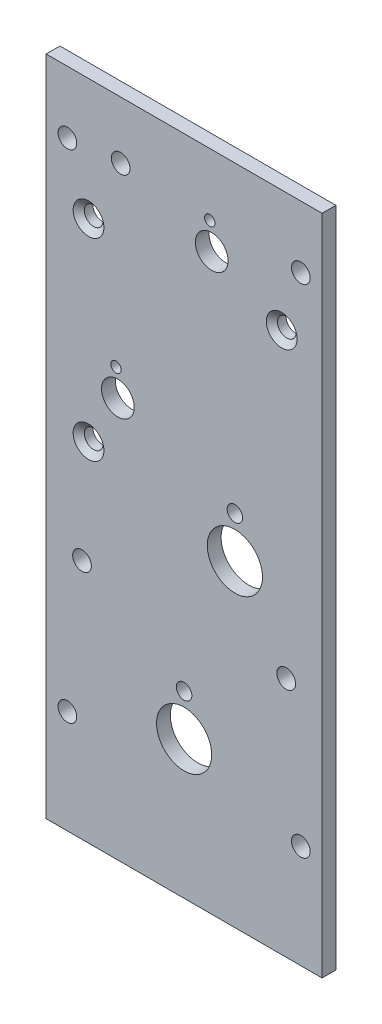
ISO-10303-21;
HEADER;
FILE_DESCRIPTION(('STEP AP214'),'2;1');
FILE_NAME('part.step','',(''),(''),'','','');
FILE_SCHEMA(('AUTOMOTIVE_DESIGN { 1 0 10303 214 1 1 1 1 }'));
ENDSEC;
DATA;
#1=APPLICATION_CONTEXT('core data for automotive mechanical design processes');
#2=APPLICATION_PROTOCOL_DEFINITION('international standard','automotive_design',2000,#1);
#3=PRODUCT_CONTEXT('',#1,'mechanical');
#4=PRODUCT('Part','Part','',(#3));
#5=PRODUCT_RELATED_PRODUCT_CATEGORY('part','',(#4));
#6=PRODUCT_DEFINITION_FORMATION('','',#4);
#7=PRODUCT_DEFINITION_CONTEXT('part definition',#1,'design');
#8=PRODUCT_DEFINITION('design','',#6,#7);
#9=PRODUCT_DEFINITION_SHAPE('','',#8);
#10=(LENGTH_UNIT() NAMED_UNIT(*) SI_UNIT(.MILLI.,.METRE.));
#11=(NAMED_UNIT(*) PLANE_ANGLE_UNIT() SI_UNIT($,.RADIAN.));
#12=(NAMED_UNIT(*) SI_UNIT($,.STERADIAN.) SOLID_ANGLE_UNIT());
#13=UNCERTAINTY_MEASURE_WITH_UNIT(LENGTH_MEASURE(1.E-05),#10,'distance_accuracy_value','');
#14=(GEOMETRIC_REPRESENTATION_CONTEXT(3) GLOBAL_UNCERTAINTY_ASSIGNED_CONTEXT((#13)) GLOBAL_UNIT_ASSIGNED_CONTEXT((#10,
#11,#12)) REPRESENTATION_CONTEXT('',''));
#15=CARTESIAN_POINT('',(0.,0.,0.));
#16=DIRECTION('',(0.,0.,1.));
#17=DIRECTION('',(1.,0.,0.));
#18=AXIS2_PLACEMENT_3D('',#15,#16,#17);
#19=CARTESIAN_POINT('',(-31.75,-152.4,-3.175));
#20=DIRECTION('',(0.,-1.,0.));
#21=DIRECTION('',(0.,0.,-1.));
#22=AXIS2_PLACEMENT_3D('',#19,#20,#21);
#23=PLANE('',#22);
#24=DIRECTION('',(1.,0.,0.));
#25=VECTOR('',#24,1.);
#26=CARTESIAN_POINT('',(-31.75,-152.4,0.));
#27=LINE('',#26,#25);
#28=CARTESIAN_POINT('',(-31.75,-152.4,0.));
#29=VERTEX_POINT('',#28);
#30=CARTESIAN_POINT('',(31.75,-152.4,0.));
#31=VERTEX_POINT('',#30);
#32=EDGE_CURVE('E97',#29,#31,#27,.T.);
#33=ORIENTED_EDGE('',*,*,#32,.F.);
#34=DIRECTION('',(0.,0.,1.));
#35=VECTOR('',#34,1.);
#36=CARTESIAN_POINT('',(-31.75,-152.4,-3.175));
#37=LINE('',#36,#35);
#38=CARTESIAN_POINT('',(-31.75,-152.4,-3.175));
#39=VERTEX_POINT('',#38);
#40=EDGE_CURVE('E11',#39,#29,#37,.T.);
#41=ORIENTED_EDGE('',*,*,#40,.F.);
#42=DIRECTION('',(1.,0.,0.));
#43=VECTOR('',#42,1.);
#44=CARTESIAN_POINT('',(-31.75,-152.4,-3.175));
#45=LINE('',#44,#43);
#46=CARTESIAN_POINT('',(31.75,-152.4,-3.175));
#47=VERTEX_POINT('',#46);
#48=EDGE_CURVE('E90',#39,#47,#45,.T.);
#49=ORIENTED_EDGE('',*,*,#48,.T.);
#50=DIRECTION('',(0.,0.,1.));
#51=VECTOR('',#50,1.);
#52=CARTESIAN_POINT('',(31.75,-152.4,-3.175));
#53=LINE('',#52,#51);
#54=EDGE_CURVE('E35',#47,#31,#53,.T.);
#55=ORIENTED_EDGE('',*,*,#54,.T.);
#56=EDGE_LOOP('',(#33,#41,#49,#55));
#57=FACE_BOUND('',#56,.T.);
#58=ADVANCED_FACE('F32',(#57),#23,.T.);
#59=CARTESIAN_POINT('',(-31.75,0.,-3.175));
#60=DIRECTION('',(-1.,0.,0.));
#61=DIRECTION('',(0.,0.,1.));
#62=AXIS2_PLACEMENT_3D('',#59,#60,#61);
#63=PLANE('',#62);
#64=DIRECTION('',(0.,-1.,0.));
#65=VECTOR('',#64,1.);
#66=CARTESIAN_POINT('',(-31.75,0.,0.));
#67=LINE('',#66,#65);
#68=CARTESIAN_POINT('',(-31.75,0.,0.));
#69=VERTEX_POINT('',#68);
#70=EDGE_CURVE('E92',#69,#29,#67,.T.);
#71=ORIENTED_EDGE('',*,*,#70,.F.);
#72=DIRECTION('',(0.,0.,1.));
#73=VECTOR('',#72,1.);
#74=CARTESIAN_POINT('',(-31.75,0.,-3.175));
#75=LINE('',#74,#73);
#76=CARTESIAN_POINT('',(-31.75,0.,-3.175));
#77=VERTEX_POINT('',#76);
#78=EDGE_CURVE('E41',#77,#69,#75,.T.);
#79=ORIENTED_EDGE('',*,*,#78,.F.);
#80=DIRECTION('',(0.,-1.,0.));
#81=VECTOR('',#80,1.);
#82=CARTESIAN_POINT('',(-31.75,0.,-3.175));
#83=LINE('',#82,#81);
#84=EDGE_CURVE('E87',#77,#39,#83,.T.);
#85=ORIENTED_EDGE('',*,*,#84,.T.);
#86=ORIENTED_EDGE('',*,*,#40,.T.);
#87=EDGE_LOOP('',(#71,#79,#85,#86));
#88=FACE_BOUND('',#87,.T.);
#89=ADVANCED_FACE('F108',(#88),#63,.T.);
#90=CARTESIAN_POINT('',(31.75,0.,-3.175));
#91=DIRECTION('',(0.,1.,0.));
#92=DIRECTION('',(0.,0.,1.));
#93=AXIS2_PLACEMENT_3D('',#90,#91,#92);
#94=PLANE('',#93);
#95=DIRECTION('',(-1.,0.,0.));
#96=VECTOR('',#95,1.);
#97=CARTESIAN_POINT('',(31.75,0.,0.));
#98=LINE('',#97,#96);
#99=CARTESIAN_POINT('',(31.75,0.,0.));
#100=VERTEX_POINT('',#99);
#101=EDGE_CURVE('E82',#100,#69,#98,.T.);
#102=ORIENTED_EDGE('',*,*,#101,.F.);
#103=DIRECTION('',(0.,0.,1.));
#104=VECTOR('',#103,1.);
#105=CARTESIAN_POINT('',(31.75,0.,-3.175));
#106=LINE('',#105,#104);
#107=CARTESIAN_POINT('',(31.75,0.,-3.175));
#108=VERTEX_POINT('',#107);
#109=EDGE_CURVE('E77',#108,#100,#106,.T.);
#110=ORIENTED_EDGE('',*,*,#109,.F.);
#111=DIRECTION('',(-1.,0.,0.));
#112=VECTOR('',#111,1.);
#113=CARTESIAN_POINT('',(31.75,0.,-3.175));
#114=LINE('',#113,#112);
#115=EDGE_CURVE('E80',#108,#77,#114,.T.);
#116=ORIENTED_EDGE('',*,*,#115,.T.);
#117=ORIENTED_EDGE('',*,*,#78,.T.);
#118=EDGE_LOOP('',(#102,#110,#116,#117));
#119=FACE_BOUND('',#118,.T.);
#120=ADVANCED_FACE('F79',(#119),#94,.T.);
#121=CARTESIAN_POINT('',(31.75,-152.4,-3.175));
#122=DIRECTION('',(1.,0.,0.));
#123=DIRECTION('',(0.,0.,-1.));
#124=AXIS2_PLACEMENT_3D('',#121,#122,#123);
#125=PLANE('',#124);
#126=DIRECTION('',(0.,1.,0.));
#127=VECTOR('',#126,1.);
#128=CARTESIAN_POINT('',(31.75,-152.4,0.));
#129=LINE('',#128,#127);
#130=EDGE_CURVE('E100',#31,#100,#129,.T.);
#131=ORIENTED_EDGE('',*,*,#130,.F.);
#132=ORIENTED_EDGE('',*,*,#54,.F.);
#133=DIRECTION('',(0.,1.,0.));
#134=VECTOR('',#133,1.);
#135=CARTESIAN_POINT('',(31.75,-152.4,-3.175));
#136=LINE('',#135,#134);
#137=EDGE_CURVE('E86',#47,#108,#136,.T.);
#138=ORIENTED_EDGE('',*,*,#137,.T.);
#139=ORIENTED_EDGE('',*,*,#109,.T.);
#140=EDGE_LOOP('',(#131,#132,#138,#139));
#141=FACE_BOUND('',#140,.T.);
#142=ADVANCED_FACE('F89',(#141),#125,.T.);
#143=CARTESIAN_POINT('',(0.,0.,-3.175));
#144=DIRECTION('',(0.,0.,1.));
#145=DIRECTION('',(1.,0.,0.));
#146=AXIS2_PLACEMENT_3D('',#143,#144,#145);
#147=PLANE('',#146);
#148=CARTESIAN_POINT('',(-15.6883805351196,-54.3417772149383,-3.175));
#149=DIRECTION('',(0.,0.,1.));
#150=DIRECTION('',(1.,0.,0.));
#151=AXIS2_PLACEMENT_3D('',#148,#149,#150);
#152=CIRCLE('',#151,1.190625);
#153=CARTESIAN_POINT('',(-14.4977555351196,-54.3417772149383,-3.175));
#154=VERTEX_POINT('',#153);
#155=EDGE_CURVE('E217',#154,#154,#152,.T.);
#156=ORIENTED_EDGE('',*,*,#155,.T.);
#157=EDGE_LOOP('',(#156));
#158=FACE_BOUND('',#157,.T.);
#159=CARTESIAN_POINT('',(5.9016194648804,-14.3367772149383,-3.175));
#160=DIRECTION('',(0.,0.,1.));
#161=DIRECTION('',(1.,0.,0.));
#162=AXIS2_PLACEMENT_3D('',#159,#160,#161);
#163=CIRCLE('',#162,1.190625);
#164=CARTESIAN_POINT('',(7.0922444648804,-14.3367772149383,-3.175));
#165=VERTEX_POINT('',#164);
#166=EDGE_CURVE('E227',#165,#165,#163,.T.);
#167=ORIENTED_EDGE('',*,*,#166,.T.);
#168=EDGE_LOOP('',(#167));
#169=FACE_BOUND('',#168,.T.);
#170=CARTESIAN_POINT('',(-21.99,-72.39,-3.175));
#171=DIRECTION('',(0.,0.,1.));
#172=DIRECTION('',(1.,0.,0.));
#173=AXIS2_PLACEMENT_3D('',#170,#171,#172);
#174=CIRCLE('',#173,2.15265);
#175=CARTESIAN_POINT('',(-19.83735,-72.39,-3.175));
#176=VERTEX_POINT('',#175);
#177=EDGE_CURVE('E236',#176,#176,#174,.T.);
#178=ORIENTED_EDGE('',*,*,#177,.T.);
#179=EDGE_LOOP('',(#178));
#180=FACE_BOUND('',#179,.T.);
#181=CARTESIAN_POINT('',(-21.99,-27.94,-3.175));
#182=DIRECTION('',(0.,0.,1.));
#183=DIRECTION('',(1.,0.,0.));
#184=AXIS2_PLACEMENT_3D('',#181,#182,#183);
#185=CIRCLE('',#184,2.15265);
#186=CARTESIAN_POINT('',(-19.83735,-27.94,-3.175));
#187=VERTEX_POINT('',#186);
#188=EDGE_CURVE('E245',#187,#187,#185,.T.);
#189=ORIENTED_EDGE('',*,*,#188,.T.);
#190=EDGE_LOOP('',(#189));
#191=FACE_BOUND('',#190,.T.);
#192=CARTESIAN_POINT('',(22.46,-27.94,-3.175));
#193=DIRECTION('',(0.,0.,1.));
#194=DIRECTION('',(1.,0.,0.));
#195=AXIS2_PLACEMENT_3D('',#192,#193,#194);
#196=CIRCLE('',#195,2.15265);
#197=CARTESIAN_POINT('',(24.61265,-27.94,-3.175));
#198=VERTEX_POINT('',#197);
#199=EDGE_CURVE('E254',#198,#198,#196,.T.);
#200=ORIENTED_EDGE('',*,*,#199,.T.);
#201=EDGE_LOOP('',(#200));
#202=FACE_BOUND('',#201,.T.);
#203=CARTESIAN_POINT('',(-15.2400000000001,-60.325,-3.175));
#204=DIRECTION('',(0.,0.,1.));
#205=DIRECTION('',(1.,0.,0.));
#206=AXIS2_PLACEMENT_3D('',#203,#204,#205);
#207=CIRCLE('',#206,3.770376);
#208=CARTESIAN_POINT('',(-11.4696240000001,-60.325,-3.175));
#209=VERTEX_POINT('',#208);
#210=EDGE_CURVE('E260',#209,#209,#207,.T.);
#211=ORIENTED_EDGE('',*,*,#210,.T.);
#212=EDGE_LOOP('',(#211));
#213=FACE_BOUND('',#212,.T.);
#214=CARTESIAN_POINT('',(6.34999999999997,-20.32,-3.175));
#215=DIRECTION('',(0.,0.,1.));
#216=DIRECTION('',(1.,0.,0.));
#217=AXIS2_PLACEMENT_3D('',#214,#215,#216);
#218=CIRCLE('',#217,3.770376);
#219=CARTESIAN_POINT('',(10.120376,-20.32,-3.175));
#220=VERTEX_POINT('',#219);
#221=EDGE_CURVE('E266',#220,#220,#218,.T.);
#222=ORIENTED_EDGE('',*,*,#221,.T.);
#223=EDGE_LOOP('',(#222));
#224=FACE_BOUND('',#223,.T.);
#225=CARTESIAN_POINT('',(0.,-111.125,-3.175));
#226=DIRECTION('',(0.,0.,1.));
#227=DIRECTION('',(1.,0.,0.));
#228=AXIS2_PLACEMENT_3D('',#225,#226,#227);
#229=CIRCLE('',#228,1.786001);
#230=CARTESIAN_POINT('',(1.78600099999997,-111.125,-3.175));
#231=VERTEX_POINT('',#230);
#232=EDGE_CURVE('E272',#231,#231,#229,.T.);
#233=ORIENTED_EDGE('',*,*,#232,.T.);
#234=EDGE_LOOP('',(#233));
#235=FACE_BOUND('',#234,.T.);
#236=CARTESIAN_POINT('',(11.684,-69.85,-3.175));
#237=DIRECTION('',(0.,0.,1.));
#238=DIRECTION('',(1.,0.,0.));
#239=AXIS2_PLACEMENT_3D('',#236,#237,#238);
#240=CIRCLE('',#239,1.786001);
#241=CARTESIAN_POINT('',(13.470001,-69.85,-3.175));
#242=VERTEX_POINT('',#241);
#243=EDGE_CURVE('E278',#242,#242,#240,.T.);
#244=ORIENTED_EDGE('',*,*,#243,.T.);
#245=EDGE_LOOP('',(#244));
#246=FACE_BOUND('',#245,.T.);
#247=CARTESIAN_POINT('',(11.684,-79.375,-3.175));
#248=DIRECTION('',(0.,0.,1.));
#249=DIRECTION('',(1.,0.,0.));
#250=AXIS2_PLACEMENT_3D('',#247,#248,#249);
#251=CIRCLE('',#250,6.35);
#252=CARTESIAN_POINT('',(18.034,-79.375,-3.175));
#253=VERTEX_POINT('',#252);
#254=EDGE_CURVE('E284',#253,#253,#251,.T.);
#255=ORIENTED_EDGE('',*,*,#254,.T.);
#256=EDGE_LOOP('',(#255));
#257=FACE_BOUND('',#256,.T.);
#258=CARTESIAN_POINT('',(0.,-120.65,-3.175));
#259=DIRECTION('',(0.,0.,1.));
#260=DIRECTION('',(1.,0.,0.));
#261=AXIS2_PLACEMENT_3D('',#258,#259,#260);
#262=CIRCLE('',#261,6.35);
#263=CARTESIAN_POINT('',(6.34999999999997,-120.65,-3.175));
#264=VERTEX_POINT('',#263);
#265=EDGE_CURVE('E290',#264,#264,#262,.T.);
#266=ORIENTED_EDGE('',*,*,#265,.T.);
#267=EDGE_LOOP('',(#266));
#268=FACE_BOUND('',#267,.T.);
#269=CARTESIAN_POINT('',(-23.495,-96.8375,-3.175));
#270=DIRECTION('',(0.,0.,1.));
#271=DIRECTION('',(1.,0.,0.));
#272=AXIS2_PLACEMENT_3D('',#269,#270,#271);
#273=CIRCLE('',#272,2.15265);
#274=CARTESIAN_POINT('',(-21.34235,-96.8375,-3.175));
#275=VERTEX_POINT('',#274);
#276=EDGE_CURVE('E296',#275,#275,#273,.T.);
#277=ORIENTED_EDGE('',*,*,#276,.T.);
#278=EDGE_LOOP('',(#277));
#279=FACE_BOUND('',#278,.T.);
#280=CARTESIAN_POINT('',(23.495,-96.8375,-3.175));
#281=DIRECTION('',(0.,0.,1.));
#282=DIRECTION('',(1.,0.,0.));
#283=AXIS2_PLACEMENT_3D('',#280,#281,#282);
#284=CIRCLE('',#283,2.15265);
#285=CARTESIAN_POINT('',(25.64765,-96.8375,-3.175));
#286=VERTEX_POINT('',#285);
#287=EDGE_CURVE('E302',#286,#286,#284,.T.);
#288=ORIENTED_EDGE('',*,*,#287,.T.);
#289=EDGE_LOOP('',(#288));
#290=FACE_BOUND('',#289,.T.);
#291=CARTESIAN_POINT('',(-14.605,-13.208,-3.175));
#292=DIRECTION('',(0.,0.,1.));
#293=DIRECTION('',(1.,0.,0.));
#294=AXIS2_PLACEMENT_3D('',#291,#292,#293);
#295=CIRCLE('',#294,2.15265);
#296=CARTESIAN_POINT('',(-12.45235,-13.208,-3.175));
#297=VERTEX_POINT('',#296);
#298=EDGE_CURVE('E308',#297,#297,#295,.T.);
#299=ORIENTED_EDGE('',*,*,#298,.T.);
#300=EDGE_LOOP('',(#299));
#301=FACE_BOUND('',#300,.T.);
#302=CARTESIAN_POINT('',(-26.8605000000003,-14.2875,-3.175));
#303=DIRECTION('',(0.,0.,1.));
#304=DIRECTION('',(1.,0.,0.));
#305=AXIS2_PLACEMENT_3D('',#302,#303,#304);
#306=CIRCLE('',#305,2.15265);
#307=CARTESIAN_POINT('',(-24.7078500000003,-14.2875,-3.175));
#308=VERTEX_POINT('',#307);
#309=EDGE_CURVE('E314',#308,#308,#306,.T.);
#310=ORIENTED_EDGE('',*,*,#309,.T.);
#311=EDGE_LOOP('',(#310));
#312=FACE_BOUND('',#311,.T.);
#313=CARTESIAN_POINT('',(26.8605,-14.2875,-3.175));
#314=DIRECTION('',(0.,0.,1.));
#315=DIRECTION('',(1.,0.,0.));
#316=AXIS2_PLACEMENT_3D('',#313,#314,#315);
#317=CIRCLE('',#316,2.15265);
#318=CARTESIAN_POINT('',(29.01315,-14.2875,-3.175));
#319=VERTEX_POINT('',#318);
#320=EDGE_CURVE('E320',#319,#319,#317,.T.);
#321=ORIENTED_EDGE('',*,*,#320,.T.);
#322=EDGE_LOOP('',(#321));
#323=FACE_BOUND('',#322,.T.);
#324=CARTESIAN_POINT('',(26.8605,-128.5875,-3.175));
#325=DIRECTION('',(0.,0.,1.));
#326=DIRECTION('',(1.,0.,0.));
#327=AXIS2_PLACEMENT_3D('',#324,#325,#326);
#328=CIRCLE('',#327,2.15265);
#329=CARTESIAN_POINT('',(29.01315,-128.5875,-3.175));
#330=VERTEX_POINT('',#329);
#331=EDGE_CURVE('E326',#330,#330,#328,.T.);
#332=ORIENTED_EDGE('',*,*,#331,.T.);
#333=EDGE_LOOP('',(#332));
#334=FACE_BOUND('',#333,.T.);
#335=CARTESIAN_POINT('',(-26.8605000000004,-128.5875,-3.175));
#336=DIRECTION('',(0.,0.,1.));
#337=DIRECTION('',(1.,0.,0.));
#338=AXIS2_PLACEMENT_3D('',#335,#336,#337);
#339=CIRCLE('',#338,2.15265);
#340=CARTESIAN_POINT('',(-24.7078500000004,-128.5875,-3.175));
#341=VERTEX_POINT('',#340);
#342=EDGE_CURVE('E101',#341,#341,#339,.T.);
#343=ORIENTED_EDGE('',*,*,#342,.T.);
#344=EDGE_LOOP('',(#343));
#345=FACE_BOUND('',#344,.T.);
#346=ORIENTED_EDGE('',*,*,#48,.F.);
#347=ORIENTED_EDGE('',*,*,#84,.F.);
#348=ORIENTED_EDGE('',*,*,#115,.F.);
#349=ORIENTED_EDGE('',*,*,#137,.F.);
#350=EDGE_LOOP('',(#346,#347,#348,#349));
#351=FACE_BOUND('',#350,.T.);
#352=ADVANCED_FACE('F85',(#158,#169,#180,#191,#202,#213,#224,#235,#246,#257,#268,#279,#290,#301,
#312,#323,#334,#345,#351),#147,.F.);
#353=CARTESIAN_POINT('',(0.,0.,0.));
#354=DIRECTION('',(0.,0.,1.));
#355=DIRECTION('',(1.,0.,0.));
#356=AXIS2_PLACEMENT_3D('',#353,#354,#355);
#357=PLANE('',#356);
#358=CARTESIAN_POINT('',(-15.6883805351196,-54.3417772149383,0.));
#359=DIRECTION('',(0.,0.,1.));
#360=DIRECTION('',(1.,0.,0.));
#361=AXIS2_PLACEMENT_3D('',#358,#359,#360);
#362=CIRCLE('',#361,1.190625);
#363=CARTESIAN_POINT('',(-14.4977555351196,-54.3417772149383,0.));
#364=VERTEX_POINT('',#363);
#365=EDGE_CURVE('E220',#364,#364,#362,.T.);
#366=ORIENTED_EDGE('',*,*,#365,.F.);
#367=EDGE_LOOP('',(#366));
#368=FACE_BOUND('',#367,.T.);
#369=CARTESIAN_POINT('',(5.9016194648804,-14.3367772149383,0.));
#370=DIRECTION('',(0.,0.,1.));
#371=DIRECTION('',(1.,0.,0.));
#372=AXIS2_PLACEMENT_3D('',#369,#370,#371);
#373=CIRCLE('',#372,1.190625);
#374=CARTESIAN_POINT('',(7.0922444648804,-14.3367772149383,0.));
#375=VERTEX_POINT('',#374);
#376=EDGE_CURVE('E222',#375,#375,#373,.T.);
#377=ORIENTED_EDGE('',*,*,#376,.F.);
#378=EDGE_LOOP('',(#377));
#379=FACE_BOUND('',#378,.T.);
#380=CARTESIAN_POINT('',(-21.99,-72.39,0.));
#381=DIRECTION('',(0.,0.,1.));
#382=DIRECTION('',(1.,0.,0.));
#383=AXIS2_PLACEMENT_3D('',#380,#381,#382);
#384=CIRCLE('',#383,3.5433);
#385=CARTESIAN_POINT('',(-18.4467,-72.39,0.));
#386=VERTEX_POINT('',#385);
#387=EDGE_CURVE('E230',#386,#386,#384,.T.);
#388=ORIENTED_EDGE('',*,*,#387,.F.);
#389=EDGE_LOOP('',(#388));
#390=FACE_BOUND('',#389,.T.);
#391=CARTESIAN_POINT('',(-21.99,-27.94,0.));
#392=DIRECTION('',(0.,0.,1.));
#393=DIRECTION('',(1.,0.,0.));
#394=AXIS2_PLACEMENT_3D('',#391,#392,#393);
#395=CIRCLE('',#394,3.5433);
#396=CARTESIAN_POINT('',(-18.4467,-27.94,0.));
#397=VERTEX_POINT('',#396);
#398=EDGE_CURVE('E239',#397,#397,#395,.T.);
#399=ORIENTED_EDGE('',*,*,#398,.F.);
#400=EDGE_LOOP('',(#399));
#401=FACE_BOUND('',#400,.T.);
#402=CARTESIAN_POINT('',(22.46,-27.94,0.));
#403=DIRECTION('',(0.,0.,1.));
#404=DIRECTION('',(1.,0.,0.));
#405=AXIS2_PLACEMENT_3D('',#402,#403,#404);
#406=CIRCLE('',#405,3.5433);
#407=CARTESIAN_POINT('',(26.0033,-27.94,0.));
#408=VERTEX_POINT('',#407);
#409=EDGE_CURVE('E248',#408,#408,#406,.T.);
#410=ORIENTED_EDGE('',*,*,#409,.F.);
#411=EDGE_LOOP('',(#410));
#412=FACE_BOUND('',#411,.T.);
#413=CARTESIAN_POINT('',(-15.2400000000001,-60.325,0.));
#414=DIRECTION('',(0.,0.,1.));
#415=DIRECTION('',(1.,0.,0.));
#416=AXIS2_PLACEMENT_3D('',#413,#414,#415);
#417=CIRCLE('',#416,3.770376);
#418=CARTESIAN_POINT('',(-11.4696240000001,-60.325,0.));
#419=VERTEX_POINT('',#418);
#420=EDGE_CURVE('E257',#419,#419,#417,.T.);
#421=ORIENTED_EDGE('',*,*,#420,.F.);
#422=EDGE_LOOP('',(#421));
#423=FACE_BOUND('',#422,.T.);
#424=CARTESIAN_POINT('',(6.34999999999997,-20.32,0.));
#425=DIRECTION('',(0.,0.,1.));
#426=DIRECTION('',(1.,0.,0.));
#427=AXIS2_PLACEMENT_3D('',#424,#425,#426);
#428=CIRCLE('',#427,3.770376);
#429=CARTESIAN_POINT('',(10.120376,-20.32,0.));
#430=VERTEX_POINT('',#429);
#431=EDGE_CURVE('E263',#430,#430,#428,.T.);
#432=ORIENTED_EDGE('',*,*,#431,.F.);
#433=EDGE_LOOP('',(#432));
#434=FACE_BOUND('',#433,.T.);
#435=CARTESIAN_POINT('',(0.,-111.125,0.));
#436=DIRECTION('',(0.,0.,1.));
#437=DIRECTION('',(1.,0.,0.));
#438=AXIS2_PLACEMENT_3D('',#435,#436,#437);
#439=CIRCLE('',#438,1.786001);
#440=CARTESIAN_POINT('',(1.78600099999997,-111.125,0.));
#441=VERTEX_POINT('',#440);
#442=EDGE_CURVE('E269',#441,#441,#439,.T.);
#443=ORIENTED_EDGE('',*,*,#442,.F.);
#444=EDGE_LOOP('',(#443));
#445=FACE_BOUND('',#444,.T.);
#446=CARTESIAN_POINT('',(11.684,-69.85,0.));
#447=DIRECTION('',(0.,0.,1.));
#448=DIRECTION('',(1.,0.,0.));
#449=AXIS2_PLACEMENT_3D('',#446,#447,#448);
#450=CIRCLE('',#449,1.786001);
#451=CARTESIAN_POINT('',(13.470001,-69.85,0.));
#452=VERTEX_POINT('',#451);
#453=EDGE_CURVE('E275',#452,#452,#450,.T.);
#454=ORIENTED_EDGE('',*,*,#453,.F.);
#455=EDGE_LOOP('',(#454));
#456=FACE_BOUND('',#455,.T.);
#457=CARTESIAN_POINT('',(11.684,-79.375,0.));
#458=DIRECTION('',(0.,0.,1.));
#459=DIRECTION('',(1.,0.,0.));
#460=AXIS2_PLACEMENT_3D('',#457,#458,#459);
#461=CIRCLE('',#460,6.35);
#462=CARTESIAN_POINT('',(18.034,-79.375,0.));
#463=VERTEX_POINT('',#462);
#464=EDGE_CURVE('E281',#463,#463,#461,.T.);
#465=ORIENTED_EDGE('',*,*,#464,.F.);
#466=EDGE_LOOP('',(#465));
#467=FACE_BOUND('',#466,.T.);
#468=CARTESIAN_POINT('',(0.,-120.65,0.));
#469=DIRECTION('',(0.,0.,1.));
#470=DIRECTION('',(1.,0.,0.));
#471=AXIS2_PLACEMENT_3D('',#468,#469,#470);
#472=CIRCLE('',#471,6.35);
#473=CARTESIAN_POINT('',(6.34999999999997,-120.65,0.));
#474=VERTEX_POINT('',#473);
#475=EDGE_CURVE('E287',#474,#474,#472,.T.);
#476=ORIENTED_EDGE('',*,*,#475,.F.);
#477=EDGE_LOOP('',(#476));
#478=FACE_BOUND('',#477,.T.);
#479=CARTESIAN_POINT('',(-23.495,-96.8375,0.));
#480=DIRECTION('',(0.,0.,1.));
#481=DIRECTION('',(1.,0.,0.));
#482=AXIS2_PLACEMENT_3D('',#479,#480,#481);
#483=CIRCLE('',#482,2.15265);
#484=CARTESIAN_POINT('',(-21.34235,-96.8375,0.));
#485=VERTEX_POINT('',#484);
#486=EDGE_CURVE('E293',#485,#485,#483,.T.);
#487=ORIENTED_EDGE('',*,*,#486,.F.);
#488=EDGE_LOOP('',(#487));
#489=FACE_BOUND('',#488,.T.);
#490=CARTESIAN_POINT('',(23.495,-96.8375,0.));
#491=DIRECTION('',(0.,0.,1.));
#492=DIRECTION('',(1.,0.,0.));
#493=AXIS2_PLACEMENT_3D('',#490,#491,#492);
#494=CIRCLE('',#493,2.15265);
#495=CARTESIAN_POINT('',(25.64765,-96.8375,0.));
#496=VERTEX_POINT('',#495);
#497=EDGE_CURVE('E299',#496,#496,#494,.T.);
#498=ORIENTED_EDGE('',*,*,#497,.F.);
#499=EDGE_LOOP('',(#498));
#500=FACE_BOUND('',#499,.T.);
#501=CARTESIAN_POINT('',(-14.605,-13.208,0.));
#502=DIRECTION('',(0.,0.,1.));
#503=DIRECTION('',(1.,0.,0.));
#504=AXIS2_PLACEMENT_3D('',#501,#502,#503);
#505=CIRCLE('',#504,2.15265);
#506=CARTESIAN_POINT('',(-12.45235,-13.208,0.));
#507=VERTEX_POINT('',#506);
#508=EDGE_CURVE('E305',#507,#507,#505,.T.);
#509=ORIENTED_EDGE('',*,*,#508,.F.);
#510=EDGE_LOOP('',(#509));
#511=FACE_BOUND('',#510,.T.);
#512=CARTESIAN_POINT('',(-26.8605000000003,-14.2875,0.));
#513=DIRECTION('',(0.,0.,1.));
#514=DIRECTION('',(1.,0.,0.));
#515=AXIS2_PLACEMENT_3D('',#512,#513,#514);
#516=CIRCLE('',#515,2.15265);
#517=CARTESIAN_POINT('',(-24.7078500000003,-14.2875,0.));
#518=VERTEX_POINT('',#517);
#519=EDGE_CURVE('E311',#518,#518,#516,.T.);
#520=ORIENTED_EDGE('',*,*,#519,.F.);
#521=EDGE_LOOP('',(#520));
#522=FACE_BOUND('',#521,.T.);
#523=CARTESIAN_POINT('',(26.8605,-14.2875,0.));
#524=DIRECTION('',(0.,0.,1.));
#525=DIRECTION('',(1.,0.,0.));
#526=AXIS2_PLACEMENT_3D('',#523,#524,#525);
#527=CIRCLE('',#526,2.15265);
#528=CARTESIAN_POINT('',(29.01315,-14.2875,0.));
#529=VERTEX_POINT('',#528);
#530=EDGE_CURVE('E317',#529,#529,#527,.T.);
#531=ORIENTED_EDGE('',*,*,#530,.F.);
#532=EDGE_LOOP('',(#531));
#533=FACE_BOUND('',#532,.T.);
#534=CARTESIAN_POINT('',(26.8605,-128.5875,0.));
#535=DIRECTION('',(0.,0.,1.));
#536=DIRECTION('',(1.,0.,0.));
#537=AXIS2_PLACEMENT_3D('',#534,#535,#536);
#538=CIRCLE('',#537,2.15265);
#539=CARTESIAN_POINT('',(29.01315,-128.5875,0.));
#540=VERTEX_POINT('',#539);
#541=EDGE_CURVE('E323',#540,#540,#538,.T.);
#542=ORIENTED_EDGE('',*,*,#541,.F.);
#543=EDGE_LOOP('',(#542));
#544=FACE_BOUND('',#543,.T.);
#545=CARTESIAN_POINT('',(-26.8605000000004,-128.5875,0.));
#546=DIRECTION('',(0.,0.,1.));
#547=DIRECTION('',(1.,0.,0.));
#548=AXIS2_PLACEMENT_3D('',#545,#546,#547);
#549=CIRCLE('',#548,2.15265);
#550=CARTESIAN_POINT('',(-24.7078500000004,-128.5875,0.));
#551=VERTEX_POINT('',#550);
#552=EDGE_CURVE('E329',#551,#551,#549,.T.);
#553=ORIENTED_EDGE('',*,*,#552,.F.);
#554=EDGE_LOOP('',(#553));
#555=FACE_BOUND('',#554,.T.);
#556=ORIENTED_EDGE('',*,*,#32,.T.);
#557=ORIENTED_EDGE('',*,*,#130,.T.);
#558=ORIENTED_EDGE('',*,*,#101,.T.);
#559=ORIENTED_EDGE('',*,*,#70,.T.);
#560=EDGE_LOOP('',(#556,#557,#558,#559));
#561=FACE_BOUND('',#560,.T.);
#562=ADVANCED_FACE('F107',(#368,#379,#390,#401,#412,#423,#434,#445,#456,#467,#478,#489,#500,
#511,#522,#533,#544,#555,#561),#357,.T.);
#563=CARTESIAN_POINT('',(-26.8605000000004,-128.5875,0.));
#564=DIRECTION('',(0.,0.,1.));
#565=DIRECTION('',(1.,0.,0.));
#566=AXIS2_PLACEMENT_3D('',#563,#564,#565);
#567=CYLINDRICAL_SURFACE('',#566,2.15265);
#568=ORIENTED_EDGE('',*,*,#342,.F.);
#569=EDGE_LOOP('',(#568));
#570=FACE_BOUND('',#569,.T.);
#571=ORIENTED_EDGE('',*,*,#552,.T.);
#572=EDGE_LOOP('',(#571));
#573=FACE_BOUND('',#572,.T.);
#574=ADVANCED_FACE('F126',(#570,#573),#567,.F.);
#575=CARTESIAN_POINT('',(26.8605,-128.5875,0.));
#576=DIRECTION('',(0.,0.,1.));
#577=DIRECTION('',(1.,0.,0.));
#578=AXIS2_PLACEMENT_3D('',#575,#576,#577);
#579=CYLINDRICAL_SURFACE('',#578,2.15265);
#580=ORIENTED_EDGE('',*,*,#331,.F.);
#581=EDGE_LOOP('',(#580));
#582=FACE_BOUND('',#581,.T.);
#583=ORIENTED_EDGE('',*,*,#541,.T.);
#584=EDGE_LOOP('',(#583));
#585=FACE_BOUND('',#584,.T.);
#586=ADVANCED_FACE('F133',(#582,#585),#579,.F.);
#587=CARTESIAN_POINT('',(26.8605,-14.2875,0.));
#588=DIRECTION('',(0.,0.,1.));
#589=DIRECTION('',(1.,0.,0.));
#590=AXIS2_PLACEMENT_3D('',#587,#588,#589);
#591=CYLINDRICAL_SURFACE('',#590,2.15265);
#592=ORIENTED_EDGE('',*,*,#320,.F.);
#593=EDGE_LOOP('',(#592));
#594=FACE_BOUND('',#593,.T.);
#595=ORIENTED_EDGE('',*,*,#530,.T.);
#596=EDGE_LOOP('',(#595));
#597=FACE_BOUND('',#596,.T.);
#598=ADVANCED_FACE('F137',(#594,#597),#591,.F.);
#599=CARTESIAN_POINT('',(-26.8605000000003,-14.2875,0.));
#600=DIRECTION('',(0.,0.,1.));
#601=DIRECTION('',(1.,0.,0.));
#602=AXIS2_PLACEMENT_3D('',#599,#600,#601);
#603=CYLINDRICAL_SURFACE('',#602,2.15265);
#604=ORIENTED_EDGE('',*,*,#309,.F.);
#605=EDGE_LOOP('',(#604));
#606=FACE_BOUND('',#605,.T.);
#607=ORIENTED_EDGE('',*,*,#519,.T.);
#608=EDGE_LOOP('',(#607));
#609=FACE_BOUND('',#608,.T.);
#610=ADVANCED_FACE('F141',(#606,#609),#603,.F.);
#611=CARTESIAN_POINT('',(-14.605,-13.208,0.));
#612=DIRECTION('',(0.,0.,1.));
#613=DIRECTION('',(1.,0.,0.));
#614=AXIS2_PLACEMENT_3D('',#611,#612,#613);
#615=CYLINDRICAL_SURFACE('',#614,2.15265);
#616=ORIENTED_EDGE('',*,*,#298,.F.);
#617=EDGE_LOOP('',(#616));
#618=FACE_BOUND('',#617,.T.);
#619=ORIENTED_EDGE('',*,*,#508,.T.);
#620=EDGE_LOOP('',(#619));
#621=FACE_BOUND('',#620,.T.);
#622=ADVANCED_FACE('F145',(#618,#621),#615,.F.);
#623=CARTESIAN_POINT('',(23.495,-96.8375,0.));
#624=DIRECTION('',(0.,0.,1.));
#625=DIRECTION('',(1.,0.,0.));
#626=AXIS2_PLACEMENT_3D('',#623,#624,#625);
#627=CYLINDRICAL_SURFACE('',#626,2.15265);
#628=ORIENTED_EDGE('',*,*,#287,.F.);
#629=EDGE_LOOP('',(#628));
#630=FACE_BOUND('',#629,.T.);
#631=ORIENTED_EDGE('',*,*,#497,.T.);
#632=EDGE_LOOP('',(#631));
#633=FACE_BOUND('',#632,.T.);
#634=ADVANCED_FACE('F149',(#630,#633),#627,.F.);
#635=CARTESIAN_POINT('',(-23.495,-96.8375,0.));
#636=DIRECTION('',(0.,0.,1.));
#637=DIRECTION('',(1.,0.,0.));
#638=AXIS2_PLACEMENT_3D('',#635,#636,#637);
#639=CYLINDRICAL_SURFACE('',#638,2.15265);
#640=ORIENTED_EDGE('',*,*,#276,.F.);
#641=EDGE_LOOP('',(#640));
#642=FACE_BOUND('',#641,.T.);
#643=ORIENTED_EDGE('',*,*,#486,.T.);
#644=EDGE_LOOP('',(#643));
#645=FACE_BOUND('',#644,.T.);
#646=ADVANCED_FACE('F153',(#642,#645),#639,.F.);
#647=CARTESIAN_POINT('',(0.,-120.65,0.));
#648=DIRECTION('',(0.,0.,1.));
#649=DIRECTION('',(1.,0.,0.));
#650=AXIS2_PLACEMENT_3D('',#647,#648,#649);
#651=CYLINDRICAL_SURFACE('',#650,6.35);
#652=ORIENTED_EDGE('',*,*,#265,.F.);
#653=EDGE_LOOP('',(#652));
#654=FACE_BOUND('',#653,.T.);
#655=ORIENTED_EDGE('',*,*,#475,.T.);
#656=EDGE_LOOP('',(#655));
#657=FACE_BOUND('',#656,.T.);
#658=ADVANCED_FACE('F157',(#654,#657),#651,.F.);
#659=CARTESIAN_POINT('',(11.684,-79.375,0.));
#660=DIRECTION('',(0.,0.,1.));
#661=DIRECTION('',(1.,0.,0.));
#662=AXIS2_PLACEMENT_3D('',#659,#660,#661);
#663=CYLINDRICAL_SURFACE('',#662,6.35);
#664=ORIENTED_EDGE('',*,*,#254,.F.);
#665=EDGE_LOOP('',(#664));
#666=FACE_BOUND('',#665,.T.);
#667=ORIENTED_EDGE('',*,*,#464,.T.);
#668=EDGE_LOOP('',(#667));
#669=FACE_BOUND('',#668,.T.);
#670=ADVANCED_FACE('F161',(#666,#669),#663,.F.);
#671=CARTESIAN_POINT('',(11.684,-69.85,0.));
#672=DIRECTION('',(0.,0.,1.));
#673=DIRECTION('',(1.,0.,0.));
#674=AXIS2_PLACEMENT_3D('',#671,#672,#673);
#675=CYLINDRICAL_SURFACE('',#674,1.786001);
#676=ORIENTED_EDGE('',*,*,#243,.F.);
#677=EDGE_LOOP('',(#676));
#678=FACE_BOUND('',#677,.T.);
#679=ORIENTED_EDGE('',*,*,#453,.T.);
#680=EDGE_LOOP('',(#679));
#681=FACE_BOUND('',#680,.T.);
#682=ADVANCED_FACE('F165',(#678,#681),#675,.F.);
#683=CARTESIAN_POINT('',(0.,-111.125,0.));
#684=DIRECTION('',(0.,0.,1.));
#685=DIRECTION('',(1.,0.,0.));
#686=AXIS2_PLACEMENT_3D('',#683,#684,#685);
#687=CYLINDRICAL_SURFACE('',#686,1.786001);
#688=ORIENTED_EDGE('',*,*,#232,.F.);
#689=EDGE_LOOP('',(#688));
#690=FACE_BOUND('',#689,.T.);
#691=ORIENTED_EDGE('',*,*,#442,.T.);
#692=EDGE_LOOP('',(#691));
#693=FACE_BOUND('',#692,.T.);
#694=ADVANCED_FACE('F169',(#690,#693),#687,.F.);
#695=CARTESIAN_POINT('',(6.34999999999997,-20.32,0.));
#696=DIRECTION('',(0.,0.,1.));
#697=DIRECTION('',(1.,0.,0.));
#698=AXIS2_PLACEMENT_3D('',#695,#696,#697);
#699=CYLINDRICAL_SURFACE('',#698,3.770376);
#700=ORIENTED_EDGE('',*,*,#221,.F.);
#701=EDGE_LOOP('',(#700));
#702=FACE_BOUND('',#701,.T.);
#703=ORIENTED_EDGE('',*,*,#431,.T.);
#704=EDGE_LOOP('',(#703));
#705=FACE_BOUND('',#704,.T.);
#706=ADVANCED_FACE('F173',(#702,#705),#699,.F.);
#707=CARTESIAN_POINT('',(-15.2400000000001,-60.325,0.));
#708=DIRECTION('',(0.,0.,1.));
#709=DIRECTION('',(1.,0.,0.));
#710=AXIS2_PLACEMENT_3D('',#707,#708,#709);
#711=CYLINDRICAL_SURFACE('',#710,3.770376);
#712=ORIENTED_EDGE('',*,*,#210,.F.);
#713=EDGE_LOOP('',(#712));
#714=FACE_BOUND('',#713,.T.);
#715=ORIENTED_EDGE('',*,*,#420,.T.);
#716=EDGE_LOOP('',(#715));
#717=FACE_BOUND('',#716,.T.);
#718=ADVANCED_FACE('F177',(#714,#717),#711,.F.);
#719=CARTESIAN_POINT('',(22.46,-27.94,0.));
#720=DIRECTION('',(0.,0.,1.));
#721=DIRECTION('',(1.,0.,0.));
#722=AXIS2_PLACEMENT_3D('',#719,#720,#721);
#723=CYLINDRICAL_SURFACE('',#722,2.15265);
#724=ORIENTED_EDGE('',*,*,#199,.F.);
#725=EDGE_LOOP('',(#724));
#726=FACE_BOUND('',#725,.T.);
#727=CARTESIAN_POINT('',(22.46,-27.94,-1.16689390209668));
#728=DIRECTION('',(0.,0.,1.));
#729=DIRECTION('',(1.,0.,0.));
#730=AXIS2_PLACEMENT_3D('',#727,#728,#729);
#731=CIRCLE('',#730,2.15265);
#732=CARTESIAN_POINT('',(24.61265,-27.94,-1.16689390209668));
#733=VERTEX_POINT('',#732);
#734=EDGE_CURVE('E251',#733,#733,#731,.T.);
#735=ORIENTED_EDGE('',*,*,#734,.T.);
#736=EDGE_LOOP('',(#735));
#737=FACE_BOUND('',#736,.T.);
#738=ADVANCED_FACE('F181',(#726,#737),#723,.F.);
#739=CARTESIAN_POINT('',(22.46,-27.94,0.));
#740=DIRECTION('',(0.,0.,1.));
#741=DIRECTION('',(1.,0.,0.));
#742=AXIS2_PLACEMENT_3D('',#739,#740,#741);
#743=CONICAL_SURFACE('',#742,3.5433,0.872664625997166);
#744=ORIENTED_EDGE('',*,*,#734,.F.);
#745=EDGE_LOOP('',(#744));
#746=FACE_BOUND('',#745,.T.);
#747=ORIENTED_EDGE('',*,*,#409,.T.);
#748=EDGE_LOOP('',(#747));
#749=FACE_BOUND('',#748,.T.);
#750=ADVANCED_FACE('F185',(#746,#749),#743,.F.);
#751=CARTESIAN_POINT('',(-21.99,-27.94,0.));
#752=DIRECTION('',(0.,0.,1.));
#753=DIRECTION('',(1.,0.,0.));
#754=AXIS2_PLACEMENT_3D('',#751,#752,#753);
#755=CYLINDRICAL_SURFACE('',#754,2.15265);
#756=ORIENTED_EDGE('',*,*,#188,.F.);
#757=EDGE_LOOP('',(#756));
#758=FACE_BOUND('',#757,.T.);
#759=CARTESIAN_POINT('',(-21.99,-27.94,-1.16689390209668));
#760=DIRECTION('',(0.,0.,1.));
#761=DIRECTION('',(1.,0.,0.));
#762=AXIS2_PLACEMENT_3D('',#759,#760,#761);
#763=CIRCLE('',#762,2.15265);
#764=CARTESIAN_POINT('',(-19.83735,-27.94,-1.16689390209668));
#765=VERTEX_POINT('',#764);
#766=EDGE_CURVE('E242',#765,#765,#763,.T.);
#767=ORIENTED_EDGE('',*,*,#766,.T.);
#768=EDGE_LOOP('',(#767));
#769=FACE_BOUND('',#768,.T.);
#770=ADVANCED_FACE('F189',(#758,#769),#755,.F.);
#771=CARTESIAN_POINT('',(-21.99,-27.94,0.));
#772=DIRECTION('',(0.,0.,1.));
#773=DIRECTION('',(1.,0.,0.));
#774=AXIS2_PLACEMENT_3D('',#771,#772,#773);
#775=CONICAL_SURFACE('',#774,3.5433,0.872664625997166);
#776=ORIENTED_EDGE('',*,*,#766,.F.);
#777=EDGE_LOOP('',(#776));
#778=FACE_BOUND('',#777,.T.);
#779=ORIENTED_EDGE('',*,*,#398,.T.);
#780=EDGE_LOOP('',(#779));
#781=FACE_BOUND('',#780,.T.);
#782=ADVANCED_FACE('F193',(#778,#781),#775,.F.);
#783=CARTESIAN_POINT('',(-21.99,-72.39,0.));
#784=DIRECTION('',(0.,0.,1.));
#785=DIRECTION('',(1.,0.,0.));
#786=AXIS2_PLACEMENT_3D('',#783,#784,#785);
#787=CYLINDRICAL_SURFACE('',#786,2.15265);
#788=ORIENTED_EDGE('',*,*,#177,.F.);
#789=EDGE_LOOP('',(#788));
#790=FACE_BOUND('',#789,.T.);
#791=CARTESIAN_POINT('',(-21.99,-72.39,-1.16689390209668));
#792=DIRECTION('',(0.,0.,1.));
#793=DIRECTION('',(1.,0.,0.));
#794=AXIS2_PLACEMENT_3D('',#791,#792,#793);
#795=CIRCLE('',#794,2.15265);
#796=CARTESIAN_POINT('',(-19.83735,-72.39,-1.16689390209668));
#797=VERTEX_POINT('',#796);
#798=EDGE_CURVE('E233',#797,#797,#795,.T.);
#799=ORIENTED_EDGE('',*,*,#798,.T.);
#800=EDGE_LOOP('',(#799));
#801=FACE_BOUND('',#800,.T.);
#802=ADVANCED_FACE('F197',(#790,#801),#787,.F.);
#803=CARTESIAN_POINT('',(-21.99,-72.39,0.));
#804=DIRECTION('',(0.,0.,1.));
#805=DIRECTION('',(1.,0.,0.));
#806=AXIS2_PLACEMENT_3D('',#803,#804,#805);
#807=CONICAL_SURFACE('',#806,3.5433,0.872664625997166);
#808=ORIENTED_EDGE('',*,*,#798,.F.);
#809=EDGE_LOOP('',(#808));
#810=FACE_BOUND('',#809,.T.);
#811=ORIENTED_EDGE('',*,*,#387,.T.);
#812=EDGE_LOOP('',(#811));
#813=FACE_BOUND('',#812,.T.);
#814=ADVANCED_FACE('F201',(#810,#813),#807,.F.);
#815=CARTESIAN_POINT('',(5.9016194648804,-14.3367772149383,0.));
#816=DIRECTION('',(0.,0.,1.));
#817=DIRECTION('',(1.,0.,0.));
#818=AXIS2_PLACEMENT_3D('',#815,#816,#817);
#819=CYLINDRICAL_SURFACE('',#818,1.190625);
#820=ORIENTED_EDGE('',*,*,#166,.F.);
#821=EDGE_LOOP('',(#820));
#822=FACE_BOUND('',#821,.T.);
#823=ORIENTED_EDGE('',*,*,#376,.T.);
#824=EDGE_LOOP('',(#823));
#825=FACE_BOUND('',#824,.T.);
#826=ADVANCED_FACE('F205',(#822,#825),#819,.F.);
#827=CARTESIAN_POINT('',(-15.6883805351196,-54.3417772149383,0.));
#828=DIRECTION('',(0.,0.,1.));
#829=DIRECTION('',(1.,0.,0.));
#830=AXIS2_PLACEMENT_3D('',#827,#828,#829);
#831=CYLINDRICAL_SURFACE('',#830,1.190625);
#832=ORIENTED_EDGE('',*,*,#155,.F.);
#833=EDGE_LOOP('',(#832));
#834=FACE_BOUND('',#833,.T.);
#835=ORIENTED_EDGE('',*,*,#365,.T.);
#836=EDGE_LOOP('',(#835));
#837=FACE_BOUND('',#836,.T.);
#838=ADVANCED_FACE('F209',(#834,#837),#831,.F.);
#839=CLOSED_SHELL('',(#58,#89,#120,#142,#352,#562,#574,#586,#598,#610,#622,#634,#646,#658,#670,
#682,#694,#706,#718,#738,#750,#770,#782,#802,#814,#826,#838));
#840=MANIFOLD_SOLID_BREP('B2',#839);
#841=ADVANCED_BREP_SHAPE_REPRESENTATION('',(#18,#840),#14);
#842=SHAPE_DEFINITION_REPRESENTATION(#9,#841);
ENDSEC;
END-ISO-10303-21;
